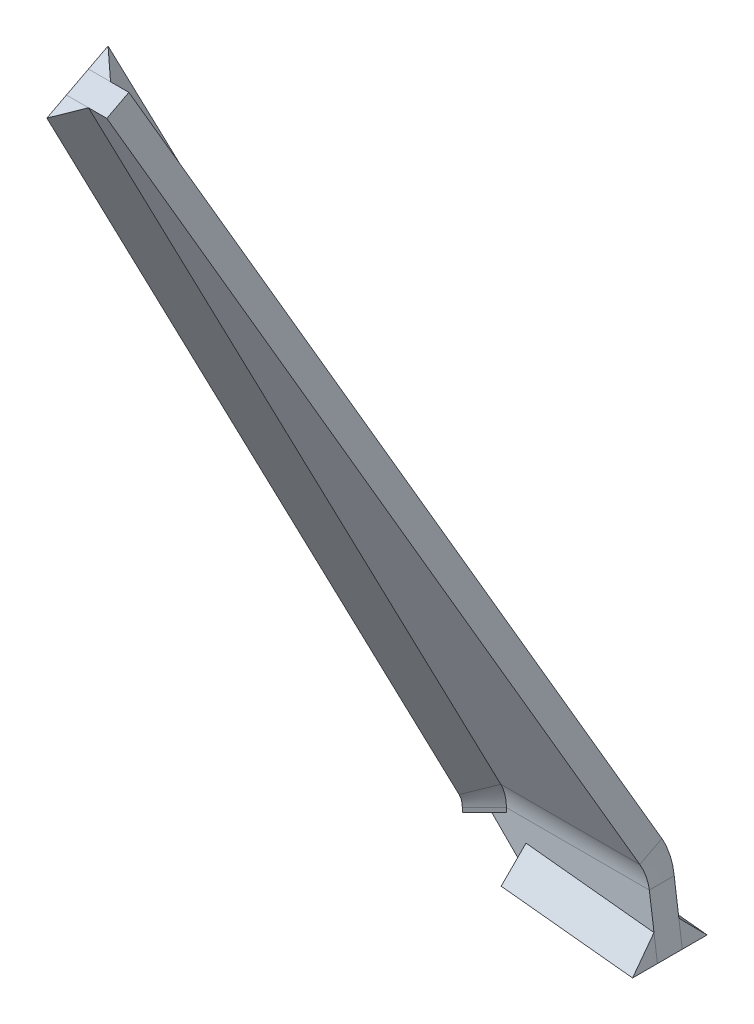
ISO-10303-21;
HEADER;
FILE_DESCRIPTION(('STEP AP214'),'2;1');
FILE_NAME('part.step','',(''),(''),'','','');
FILE_SCHEMA(('AUTOMOTIVE_DESIGN { 1 0 10303 214 1 1 1 1 }'));
ENDSEC;
DATA;
#1=APPLICATION_CONTEXT('core data for automotive mechanical design processes');
#2=APPLICATION_PROTOCOL_DEFINITION('international standard','automotive_design',2000,#1);
#3=PRODUCT_CONTEXT('',#1,'mechanical');
#4=PRODUCT('Part','Part','',(#3));
#5=PRODUCT_RELATED_PRODUCT_CATEGORY('part','',(#4));
#6=PRODUCT_DEFINITION_FORMATION('','',#4);
#7=PRODUCT_DEFINITION_CONTEXT('part definition',#1,'design');
#8=PRODUCT_DEFINITION('design','',#6,#7);
#9=PRODUCT_DEFINITION_SHAPE('','',#8);
#10=(LENGTH_UNIT() NAMED_UNIT(*) SI_UNIT(.MILLI.,.METRE.));
#11=(NAMED_UNIT(*) PLANE_ANGLE_UNIT() SI_UNIT($,.RADIAN.));
#12=(NAMED_UNIT(*) SI_UNIT($,.STERADIAN.) SOLID_ANGLE_UNIT());
#13=UNCERTAINTY_MEASURE_WITH_UNIT(LENGTH_MEASURE(1.E-05),#10,'distance_accuracy_value','');
#14=(GEOMETRIC_REPRESENTATION_CONTEXT(3) GLOBAL_UNCERTAINTY_ASSIGNED_CONTEXT((#13)) GLOBAL_UNIT_ASSIGNED_CONTEXT((#10,
#11,#12)) REPRESENTATION_CONTEXT('',''));
#15=CARTESIAN_POINT('',(0.,0.,0.));
#16=DIRECTION('',(0.,0.,1.));
#17=DIRECTION('',(1.,0.,0.));
#18=AXIS2_PLACEMENT_3D('',#15,#16,#17);
#19=CARTESIAN_POINT('',(3.54804333271289,6.67696676559559,3.99999999585428));
#20=DIRECTION('',(0.,6.51403475213452E-09,1.));
#21=DIRECTION('',(0.,-1.,6.51403475213452E-09));
#22=AXIS2_PLACEMENT_3D('',#19,#20,#21);
#23=PLANE('',#22);
#24=DIRECTION('',(-1.,0.,0.));
#25=VECTOR('',#24,1.);
#26=CARTESIAN_POINT('',(3.54804333271289,6.67696676559559,3.99999999585428));
#27=LINE('',#26,#25);
#28=CARTESIAN_POINT('',(3.54804333271289,6.67696676559559,3.99999999585428));
#29=VERTEX_POINT('',#28);
#30=CARTESIAN_POINT('',(0.,6.67696676559559,3.99999999585428));
#31=VERTEX_POINT('',#30);
#32=EDGE_CURVE('E121',#29,#31,#27,.T.);
#33=ORIENTED_EDGE('',*,*,#32,.F.);
#34=DIRECTION('',(0.,-1.,6.51403475213452E-09));
#35=VECTOR('',#34,1.);
#36=CARTESIAN_POINT('',(3.54804333271289,6.67696676559559,3.99999999585428));
#37=LINE('',#36,#35);
#38=CARTESIAN_POINT('',(3.54804333271289,6.00000000000006,4.00000000026407));
#39=VERTEX_POINT('',#38);
#40=EDGE_CURVE('E64',#29,#39,#37,.T.);
#41=ORIENTED_EDGE('',*,*,#40,.T.);
#42=DIRECTION('',(-1.,0.,0.));
#43=VECTOR('',#42,1.);
#44=CARTESIAN_POINT('',(3.54804333271289,6.00000000000006,4.00000000026407));
#45=LINE('',#44,#43);
#46=CARTESIAN_POINT('',(0.,6.00000000000006,4.00000000026407));
#47=VERTEX_POINT('',#46);
#48=EDGE_CURVE('E71',#39,#47,#45,.T.);
#49=ORIENTED_EDGE('',*,*,#48,.T.);
#50=DIRECTION('',(0.,-1.,6.51403475213452E-09));
#51=VECTOR('',#50,1.);
#52=CARTESIAN_POINT('',(0.,6.67696676559559,3.99999999585428));
#53=LINE('',#52,#51);
#54=EDGE_CURVE('E13',#31,#47,#53,.T.);
#55=ORIENTED_EDGE('',*,*,#54,.F.);
#56=EDGE_LOOP('',(#33,#41,#49,#55));
#57=FACE_BOUND('',#56,.T.);
#58=ADVANCED_FACE('F57',(#57),#23,.F.);
#59=CARTESIAN_POINT('',(0.,6.67696676463847,7.54804332856717));
#60=DIRECTION('',(-0.707106781186548,-4.60611813374007E-09,-0.707106781186547));
#61=DIRECTION('',(-0.707106781186547,0.,0.707106781186548));
#62=AXIS2_PLACEMENT_3D('',#59,#60,#61);
#63=PLANE('',#62);
#64=DIRECTION('',(0.707106781186547,1.90749860351502E-10,-0.707106781186548));
#65=VECTOR('',#64,1.);
#66=CARTESIAN_POINT('',(0.,6.67696676463847,7.54804332856717));
#67=LINE('',#66,#65);
#68=CARTESIAN_POINT('',(0.,6.67696676463847,7.54804332856717));
#69=VERTEX_POINT('',#68);
#70=EDGE_CURVE('E144',#69,#29,#67,.T.);
#71=ORIENTED_EDGE('',*,*,#70,.F.);
#72=DIRECTION('',(0.,-1.,6.51403475213452E-09));
#73=VECTOR('',#72,1.);
#74=CARTESIAN_POINT('',(0.,6.67696676463847,7.54804332856717));
#75=LINE('',#74,#73);
#76=CARTESIAN_POINT('',(0.,5.99999999904293,7.54804333297696));
#77=VERTEX_POINT('',#76);
#78=EDGE_CURVE('E116',#69,#77,#75,.T.);
#79=ORIENTED_EDGE('',*,*,#78,.T.);
#80=DIRECTION('',(0.707106781186547,1.90749860351502E-10,-0.707106781186548));
#81=VECTOR('',#80,1.);
#82=CARTESIAN_POINT('',(0.,5.99999999904293,7.54804333297696));
#83=LINE('',#82,#81);
#84=EDGE_CURVE('E79',#77,#39,#83,.T.);
#85=ORIENTED_EDGE('',*,*,#84,.T.);
#86=ORIENTED_EDGE('',*,*,#40,.F.);
#87=EDGE_LOOP('',(#71,#79,#85,#86));
#88=FACE_BOUND('',#87,.T.);
#89=ADVANCED_FACE('F157',(#88),#63,.F.);
#90=CARTESIAN_POINT('',(0.,6.67696676559554,12.0000000046738));
#91=DIRECTION('',(-1.,0.,0.));
#92=DIRECTION('',(0.,-1.,0.));
#93=AXIS2_PLACEMENT_3D('',#90,#91,#92);
#94=CYLINDRICAL_SURFACE('',#93,8.00000000881955);
#95=DIRECTION('',(-1.,0.,0.));
#96=VECTOR('',#95,1.);
#97=CARTESIAN_POINT('',(3.54804333271289,10.370955673634,4.90391333042855));
#98=LINE('',#97,#96);
#99=CARTESIAN_POINT('',(3.54804333271289,10.370955673634,4.90391333042855));
#100=VERTEX_POINT('',#99);
#101=CARTESIAN_POINT('',(0.,10.370955673634,4.90391333042855));
#102=VERTEX_POINT('',#101);
#103=EDGE_CURVE('E129',#100,#102,#98,.T.);
#104=ORIENTED_EDGE('',*,*,#103,.F.);
#105=CARTESIAN_POINT('',(3.54804333271289,6.67696676559554,12.0000000046738));
#106=DIRECTION('',(-1.,0.,0.));
#107=DIRECTION('',(0.,-1.,0.));
#108=AXIS2_PLACEMENT_3D('',#105,#106,#107);
#109=CIRCLE('',#108,8.00000000881955);
#110=EDGE_CURVE('E120',#100,#29,#109,.T.);
#111=ORIENTED_EDGE('',*,*,#110,.T.);
#112=ORIENTED_EDGE('',*,*,#32,.T.);
#113=CARTESIAN_POINT('',(0.,6.67696676559554,12.0000000046738));
#114=DIRECTION('',(-1.,0.,0.));
#115=DIRECTION('',(0.,-1.,0.));
#116=AXIS2_PLACEMENT_3D('',#113,#114,#115);
#117=CIRCLE('',#116,8.00000000881955);
#118=EDGE_CURVE('E149',#102,#31,#117,.T.);
#119=ORIENTED_EDGE('',*,*,#118,.F.);
#120=EDGE_LOOP('',(#104,#111,#112,#119));
#121=FACE_BOUND('',#120,.T.);
#122=ADVANCED_FACE('F159',(#121),#94,.T.);
#123=CARTESIAN_POINT('',(0.,6.67696676559554,12.0000000046738));
#124=DIRECTION('',(1.,0.,0.));
#125=DIRECTION('',(0.,1.,0.));
#126=AXIS2_PLACEMENT_3D('',#123,#124,#125);
#127=CONICAL_SURFACE('',#126,4.45195667610666,0.785398163397449);
#128=DIRECTION('',(0.707106781186547,0.326505575621977,-0.62721137512625));
#129=VECTOR('',#128,1.);
#130=CARTESIAN_POINT('',(0.,8.73265158505604,8.05106620313065));
#131=LINE('',#130,#129);
#132=CARTESIAN_POINT('',(0.,8.73265158505604,8.05106620313065));
#133=VERTEX_POINT('',#132);
#134=EDGE_CURVE('E124',#133,#100,#131,.T.);
#135=ORIENTED_EDGE('',*,*,#134,.F.);
#136=CARTESIAN_POINT('',(0.,6.67696676559554,12.0000000046738));
#137=DIRECTION('',(-1.,0.,0.));
#138=DIRECTION('',(0.,-1.,0.));
#139=AXIS2_PLACEMENT_3D('',#136,#137,#138);
#140=CIRCLE('',#139,4.45195667610666);
#141=EDGE_CURVE('E109',#133,#69,#140,.T.);
#142=ORIENTED_EDGE('',*,*,#141,.T.);
#143=ORIENTED_EDGE('',*,*,#70,.T.);
#144=ORIENTED_EDGE('',*,*,#110,.F.);
#145=EDGE_LOOP('',(#135,#142,#143,#144));
#146=FACE_BOUND('',#145,.T.);
#147=ADVANCED_FACE('F125',(#146),#127,.F.);
#148=CARTESIAN_POINT('',(0.,10.370955673634,4.90391333042855));
#149=DIRECTION('',(-1.,0.,0.));
#150=DIRECTION('',(0.,-1.,0.));
#151=AXIS2_PLACEMENT_3D('',#148,#149,#150);
#152=PLANE('',#151);
#153=DIRECTION('',(0.,-0.461748613235034,0.887010833178221));
#154=VECTOR('',#153,1.);
#155=CARTESIAN_POINT('',(0.,137.813981670746,71.2465534924042));
#156=LINE('',#155,#154);
#157=CARTESIAN_POINT('',(0.,137.813981670746,71.2465534924042));
#158=VERTEX_POINT('',#157);
#159=CARTESIAN_POINT('',(0.,136.175677582168,74.3937063651063));
#160=VERTEX_POINT('',#159);
#161=EDGE_CURVE('E168',#158,#160,#156,.T.);
#162=ORIENTED_EDGE('',*,*,#161,.F.);
#163=DIRECTION('',(0.,0.887010833163201,0.461748613263889));
#164=VECTOR('',#163,1.);
#165=CARTESIAN_POINT('',(0.,10.370955673634,4.90391333042855));
#166=LINE('',#165,#164);
#167=EDGE_CURVE('E138',#102,#158,#166,.T.);
#168=ORIENTED_EDGE('',*,*,#167,.F.);
#169=ORIENTED_EDGE('',*,*,#118,.T.);
#170=ORIENTED_EDGE('',*,*,#54,.T.);
#171=DIRECTION('',(0.,-2.69761157856152E-10,1.));
#172=VECTOR('',#171,1.);
#173=CARTESIAN_POINT('',(0.,6.00000000000006,4.00000000026407));
#174=LINE('',#173,#172);
#175=EDGE_CURVE('E152',#47,#77,#174,.T.);
#176=ORIENTED_EDGE('',*,*,#175,.T.);
#177=ORIENTED_EDGE('',*,*,#78,.F.);
#178=ORIENTED_EDGE('',*,*,#141,.F.);
#179=DIRECTION('',(0.,0.887010833163201,0.461748613263889));
#180=VECTOR('',#179,1.);
#181=CARTESIAN_POINT('',(0.,8.73265158505604,8.05106620313065));
#182=LINE('',#181,#180);
#183=EDGE_CURVE('E114',#133,#160,#182,.T.);
#184=ORIENTED_EDGE('',*,*,#183,.T.);
#185=EDGE_LOOP('',(#162,#168,#169,#170,#176,#177,#178,#184));
#186=FACE_BOUND('',#185,.T.);
#187=ADVANCED_FACE('F112',(#186),#152,.T.);
#188=CARTESIAN_POINT('',(3.54804333271289,10.370955673634,4.90391333042855));
#189=DIRECTION('',(0.,0.461748613263889,-0.887010833163201));
#190=DIRECTION('',(0.,0.887010833163201,0.461748613263889));
#191=AXIS2_PLACEMENT_3D('',#188,#189,#190);
#192=PLANE('',#191);
#193=DIRECTION('',(-1.,0.,0.));
#194=VECTOR('',#193,1.);
#195=CARTESIAN_POINT('',(3.54804333271288,137.813981670746,71.2465534924042));
#196=LINE('',#195,#194);
#197=CARTESIAN_POINT('',(3.54804333271288,137.813981670746,71.2465534924042));
#198=VERTEX_POINT('',#197);
#199=EDGE_CURVE('E130',#198,#158,#196,.T.);
#200=ORIENTED_EDGE('',*,*,#199,.F.);
#201=DIRECTION('',(0.,0.887010833163201,0.461748613263889));
#202=VECTOR('',#201,1.);
#203=CARTESIAN_POINT('',(3.54804333271289,10.370955673634,4.90391333042855));
#204=LINE('',#203,#202);
#205=EDGE_CURVE('E136',#100,#198,#204,.T.);
#206=ORIENTED_EDGE('',*,*,#205,.F.);
#207=ORIENTED_EDGE('',*,*,#103,.T.);
#208=ORIENTED_EDGE('',*,*,#167,.T.);
#209=EDGE_LOOP('',(#200,#206,#207,#208));
#210=FACE_BOUND('',#209,.T.);
#211=ADVANCED_FACE('F164',(#210),#192,.T.);
#212=CARTESIAN_POINT('',(0.,8.73265158505604,8.05106620313065));
#213=DIRECTION('',(0.707106781186548,-0.326505575642381,0.627211375115628));
#214=DIRECTION('',(0.663578618394135,0.,-0.748106554716727));
#215=AXIS2_PLACEMENT_3D('',#212,#213,#214);
#216=PLANE('',#215);
#217=DIRECTION('',(0.707106781186547,0.326505575621977,-0.62721137512625));
#218=VECTOR('',#217,1.);
#219=CARTESIAN_POINT('',(0.,136.175677582168,74.3937063651063));
#220=LINE('',#219,#218);
#221=EDGE_CURVE('E134',#160,#198,#220,.T.);
#222=ORIENTED_EDGE('',*,*,#221,.F.);
#223=ORIENTED_EDGE('',*,*,#183,.F.);
#224=ORIENTED_EDGE('',*,*,#134,.T.);
#225=ORIENTED_EDGE('',*,*,#205,.T.);
#226=EDGE_LOOP('',(#222,#223,#224,#225));
#227=FACE_BOUND('',#226,.T.);
#228=ADVANCED_FACE('F132',(#227),#216,.T.);
#229=CARTESIAN_POINT('',(0.,6.00000000000006,4.00000000026407));
#230=DIRECTION('',(0.,-1.,-2.69761157856152E-10));
#231=DIRECTION('',(0.,2.69761157856152E-10,-1.));
#232=AXIS2_PLACEMENT_3D('',#229,#230,#231);
#233=PLANE('',#232);
#234=ORIENTED_EDGE('',*,*,#175,.F.);
#235=ORIENTED_EDGE('',*,*,#48,.F.);
#236=ORIENTED_EDGE('',*,*,#84,.F.);
#237=EDGE_LOOP('',(#234,#235,#236));
#238=FACE_BOUND('',#237,.T.);
#239=ADVANCED_FACE('F173',(#238),#233,.T.);
#240=CARTESIAN_POINT('',(0.,137.813981670746,71.2465534924042));
#241=DIRECTION('',(0.,-0.887010833178221,-0.461748613235034));
#242=DIRECTION('',(0.,0.461748613235034,-0.887010833178221));
#243=AXIS2_PLACEMENT_3D('',#240,#241,#242);
#244=PLANE('',#243);
#245=ORIENTED_EDGE('',*,*,#161,.T.);
#246=ORIENTED_EDGE('',*,*,#221,.T.);
#247=ORIENTED_EDGE('',*,*,#199,.T.);
#248=EDGE_LOOP('',(#245,#246,#247));
#249=FACE_BOUND('',#248,.T.);
#250=ADVANCED_FACE('F167',(#249),#244,.F.);
#251=CLOSED_SHELL('',(#58,#89,#122,#147,#187,#211,#228,#239,#250));
#252=MANIFOLD_SOLID_BREP('B2',#251);
#253=CARTESIAN_POINT('',(3.54804333271289,6.67696676667466,-4.14576012408574E-09));
#254=DIRECTION('',(0.,-6.51403475213451E-09,-1.));
#255=DIRECTION('',(0.,1.,-6.51403475213451E-09));
#256=AXIS2_PLACEMENT_3D('',#253,#254,#255);
#257=PLANE('',#256);
#258=DIRECTION('',(1.,0.,0.));
#259=VECTOR('',#258,1.);
#260=CARTESIAN_POINT('',(3.54804333271289,6.67696676667466,-4.14576012408574E-09));
#261=LINE('',#260,#259);
#262=CARTESIAN_POINT('',(0.,6.67696676667466,-4.14575838936226E-09));
#263=VERTEX_POINT('',#262);
#264=CARTESIAN_POINT('',(3.54804333271289,6.67696676667466,-4.14576012408574E-09));
#265=VERTEX_POINT('',#264);
#266=EDGE_CURVE('E326',#263,#265,#261,.T.);
#267=ORIENTED_EDGE('',*,*,#266,.F.);
#268=DIRECTION('',(0.,-1.,6.51403475213452E-09));
#269=VECTOR('',#268,1.);
#270=CARTESIAN_POINT('',(0.,6.67696676667466,-4.14575838936226E-09));
#271=LINE('',#270,#269);
#272=CARTESIAN_POINT('',(0.,6.00000000107912,2.64026647767146E-10));
#273=VERTEX_POINT('',#272);
#274=EDGE_CURVE('E269',#263,#273,#271,.T.);
#275=ORIENTED_EDGE('',*,*,#274,.T.);
#276=DIRECTION('',(1.,0.,0.));
#277=VECTOR('',#276,1.);
#278=CARTESIAN_POINT('',(3.54804333271289,6.00000000107912,2.6402491304367E-10));
#279=LINE('',#278,#277);
#280=CARTESIAN_POINT('',(3.54804333271289,6.00000000107912,2.6402491304367E-10));
#281=VERTEX_POINT('',#280);
#282=EDGE_CURVE('E276',#273,#281,#279,.T.);
#283=ORIENTED_EDGE('',*,*,#282,.T.);
#284=DIRECTION('',(0.,-1.,6.51403475213452E-09));
#285=VECTOR('',#284,1.);
#286=CARTESIAN_POINT('',(3.54804333271289,6.67696676667466,-4.14576012408574E-09));
#287=LINE('',#286,#285);
#288=EDGE_CURVE('E55',#265,#281,#287,.T.);
#289=ORIENTED_EDGE('',*,*,#288,.F.);
#290=EDGE_LOOP('',(#267,#275,#283,#289));
#291=FACE_BOUND('',#290,.T.);
#292=ADVANCED_FACE('F262',(#291),#257,.F.);
#293=CARTESIAN_POINT('',(0.,6.67696676763178,-3.54804333685865));
#294=DIRECTION('',(-0.707106781186548,4.60611815849822E-09,0.707106781186547));
#295=DIRECTION('',(0.707106781186547,0.,0.707106781186548));
#296=AXIS2_PLACEMENT_3D('',#293,#294,#295);
#297=PLANE('',#296);
#298=DIRECTION('',(-0.707106781186547,1.90749971373805E-10,-0.707106781186548));
#299=VECTOR('',#298,1.);
#300=CARTESIAN_POINT('',(0.,6.67696676763178,-3.54804333685865));
#301=LINE('',#300,#299);
#302=CARTESIAN_POINT('',(0.,6.67696676763178,-3.54804333685865));
#303=VERTEX_POINT('',#302);
#304=EDGE_CURVE('E324',#265,#303,#301,.T.);
#305=ORIENTED_EDGE('',*,*,#304,.F.);
#306=ORIENTED_EDGE('',*,*,#288,.T.);
#307=DIRECTION('',(-0.707106781186547,1.90749971373805E-10,-0.707106781186548));
#308=VECTOR('',#307,1.);
#309=CARTESIAN_POINT('',(0.,6.00000000203625,-3.54804333244886));
#310=LINE('',#309,#308);
#311=CARTESIAN_POINT('',(0.,6.00000000203625,-3.54804333244886));
#312=VERTEX_POINT('',#311);
#313=EDGE_CURVE('E360',#281,#312,#310,.T.);
#314=ORIENTED_EDGE('',*,*,#313,.T.);
#315=DIRECTION('',(0.,-1.,6.51403475213452E-09));
#316=VECTOR('',#315,1.);
#317=CARTESIAN_POINT('',(0.,6.67696676763178,-3.54804333685865));
#318=LINE('',#317,#316);
#319=EDGE_CURVE('E364',#303,#312,#318,.T.);
#320=ORIENTED_EDGE('',*,*,#319,.F.);
#321=EDGE_LOOP('',(#305,#306,#314,#320));
#322=FACE_BOUND('',#321,.T.);
#323=ADVANCED_FACE('F385',(#322),#297,.F.);
#324=CARTESIAN_POINT('',(0.,6.67696676559554,12.0000000046738));
#325=DIRECTION('',(-1.,0.,0.));
#326=DIRECTION('',(0.,-1.,0.));
#327=AXIS2_PLACEMENT_3D('',#324,#325,#326);
#328=CYLINDRICAL_SURFACE('',#327,12.0000000088196);
#329=DIRECTION('',(1.,0.,0.));
#330=VECTOR('',#329,1.);
#331=CARTESIAN_POINT('',(3.54804333271289,12.2179501265742,1.35586999771564));
#332=LINE('',#331,#330);
#333=CARTESIAN_POINT('',(0.,12.2179501265742,1.35586999771564));
#334=VERTEX_POINT('',#333);
#335=CARTESIAN_POINT('',(3.54804333271289,12.2179501265742,1.35586999771564));
#336=VERTEX_POINT('',#335);
#337=EDGE_CURVE('E337',#334,#336,#332,.T.);
#338=ORIENTED_EDGE('',*,*,#337,.F.);
#339=CARTESIAN_POINT('',(0.,6.67696676559554,12.0000000046738));
#340=DIRECTION('',(-1.,0.,0.));
#341=DIRECTION('',(0.,-1.,0.));
#342=AXIS2_PLACEMENT_3D('',#339,#340,#341);
#343=CIRCLE('',#342,12.0000000088196);
#344=EDGE_CURVE('E325',#334,#263,#343,.T.);
#345=ORIENTED_EDGE('',*,*,#344,.T.);
#346=ORIENTED_EDGE('',*,*,#266,.T.);
#347=CARTESIAN_POINT('',(3.54804333271289,6.67696676559554,12.0000000046738));
#348=DIRECTION('',(-1.,0.,0.));
#349=DIRECTION('',(0.,-1.,0.));
#350=AXIS2_PLACEMENT_3D('',#347,#348,#349);
#351=CIRCLE('',#350,12.0000000088196);
#352=EDGE_CURVE('E358',#336,#265,#351,.T.);
#353=ORIENTED_EDGE('',*,*,#352,.F.);
#354=EDGE_LOOP('',(#338,#345,#346,#353));
#355=FACE_BOUND('',#354,.T.);
#356=ADVANCED_FACE('F369',(#355),#328,.F.);
#357=CARTESIAN_POINT('',(3.54804333271289,6.67696676559554,12.0000000046738));
#358=DIRECTION('',(-1.,0.,0.));
#359=DIRECTION('',(0.,-1.,0.));
#360=AXIS2_PLACEMENT_3D('',#357,#358,#359);
#361=CONICAL_SURFACE('',#360,12.0000000088196,0.785398163397448);
#362=DIRECTION('',(-0.707106781186547,0.326505575621977,-0.62721137512625));
#363=VECTOR('',#362,1.);
#364=CARTESIAN_POINT('',(0.,13.8562542151522,-1.79128287498645));
#365=LINE('',#364,#363);
#366=CARTESIAN_POINT('',(0.,13.8562542151522,-1.79128287498645));
#367=VERTEX_POINT('',#366);
#368=EDGE_CURVE('E321',#336,#367,#365,.T.);
#369=ORIENTED_EDGE('',*,*,#368,.F.);
#370=ORIENTED_EDGE('',*,*,#352,.T.);
#371=ORIENTED_EDGE('',*,*,#304,.T.);
#372=CARTESIAN_POINT('',(0.,6.67696676559554,12.0000000046738));
#373=DIRECTION('',(-1.,0.,0.));
#374=DIRECTION('',(0.,-1.,0.));
#375=AXIS2_PLACEMENT_3D('',#372,#373,#374);
#376=CIRCLE('',#375,15.5480433415325);
#377=EDGE_CURVE('E316',#367,#303,#376,.T.);
#378=ORIENTED_EDGE('',*,*,#377,.F.);
#379=EDGE_LOOP('',(#369,#370,#371,#378));
#380=FACE_BOUND('',#379,.T.);
#381=ADVANCED_FACE('F318',(#380),#361,.T.);
#382=CARTESIAN_POINT('',(0.,13.8562542151522,-1.79128287498645));
#383=DIRECTION('',(0.707106781186548,0.326505575642381,-0.627211375115628));
#384=DIRECTION('',(-0.663578618394135,0.,-0.748106554716727));
#385=AXIS2_PLACEMENT_3D('',#382,#383,#384);
#386=PLANE('',#385);
#387=DIRECTION('',(-0.707106781186547,0.326505575621977,-0.62721137512625));
#388=VECTOR('',#387,1.);
#389=CARTESIAN_POINT('',(0.,141.299280212265,64.5513572869892));
#390=LINE('',#389,#388);
#391=CARTESIAN_POINT('',(3.54804333271288,139.660976123687,67.6985101596913));
#392=VERTEX_POINT('',#391);
#393=CARTESIAN_POINT('',(0.,141.299280212265,64.5513572869892));
#394=VERTEX_POINT('',#393);
#395=EDGE_CURVE('E348',#392,#394,#390,.T.);
#396=ORIENTED_EDGE('',*,*,#395,.F.);
#397=DIRECTION('',(0.,0.887010833163201,0.461748613263889));
#398=VECTOR('',#397,1.);
#399=CARTESIAN_POINT('',(3.54804333271289,12.2179501265742,1.35586999771564));
#400=LINE('',#399,#398);
#401=EDGE_CURVE('E340',#336,#392,#400,.T.);
#402=ORIENTED_EDGE('',*,*,#401,.F.);
#403=ORIENTED_EDGE('',*,*,#368,.T.);
#404=DIRECTION('',(0.,0.887010833163201,0.461748613263889));
#405=VECTOR('',#404,1.);
#406=CARTESIAN_POINT('',(0.,13.8562542151522,-1.79128287498645));
#407=LINE('',#406,#405);
#408=EDGE_CURVE('E329',#367,#394,#407,.T.);
#409=ORIENTED_EDGE('',*,*,#408,.T.);
#410=EDGE_LOOP('',(#396,#402,#403,#409));
#411=FACE_BOUND('',#410,.T.);
#412=ADVANCED_FACE('F339',(#411),#386,.T.);
#413=CARTESIAN_POINT('',(3.54804333271289,12.2179501265742,1.35586999771564));
#414=DIRECTION('',(0.,-0.461748613263889,0.887010833163201));
#415=DIRECTION('',(0.,-0.887010833163201,-0.461748613263889));
#416=AXIS2_PLACEMENT_3D('',#413,#414,#415);
#417=PLANE('',#416);
#418=DIRECTION('',(1.,0.,0.));
#419=VECTOR('',#418,1.);
#420=CARTESIAN_POINT('',(3.54804333271288,139.660976123687,67.6985101596913));
#421=LINE('',#420,#419);
#422=CARTESIAN_POINT('',(0.,139.660976123687,67.6985101596913));
#423=VERTEX_POINT('',#422);
#424=EDGE_CURVE('E342',#423,#392,#421,.T.);
#425=ORIENTED_EDGE('',*,*,#424,.F.);
#426=DIRECTION('',(0.,0.887010833163201,0.461748613263889));
#427=VECTOR('',#426,1.);
#428=CARTESIAN_POINT('',(0.,12.2179501265742,1.35586999771564));
#429=LINE('',#428,#427);
#430=EDGE_CURVE('E336',#334,#423,#429,.T.);
#431=ORIENTED_EDGE('',*,*,#430,.F.);
#432=ORIENTED_EDGE('',*,*,#337,.T.);
#433=ORIENTED_EDGE('',*,*,#401,.T.);
#434=EDGE_LOOP('',(#425,#431,#432,#433));
#435=FACE_BOUND('',#434,.T.);
#436=ADVANCED_FACE('F372',(#435),#417,.T.);
#437=CARTESIAN_POINT('',(0.,12.2179501265742,1.35586999771564));
#438=DIRECTION('',(-1.,0.,0.));
#439=DIRECTION('',(0.,-1.,0.));
#440=AXIS2_PLACEMENT_3D('',#437,#438,#439);
#441=PLANE('',#440);
#442=DIRECTION('',(0.,-0.461748613235034,0.887010833178221));
#443=VECTOR('',#442,1.);
#444=CARTESIAN_POINT('',(0.,139.660976123687,67.6985101596913));
#445=LINE('',#444,#443);
#446=EDGE_CURVE('E332',#394,#423,#445,.T.);
#447=ORIENTED_EDGE('',*,*,#446,.F.);
#448=ORIENTED_EDGE('',*,*,#408,.F.);
#449=ORIENTED_EDGE('',*,*,#377,.T.);
#450=ORIENTED_EDGE('',*,*,#319,.T.);
#451=DIRECTION('',(0.,-2.69761157856152E-10,1.));
#452=VECTOR('',#451,1.);
#453=CARTESIAN_POINT('',(0.,6.00000000107912,2.64026647767146E-10));
#454=LINE('',#453,#452);
#455=EDGE_CURVE('E284',#312,#273,#454,.T.);
#456=ORIENTED_EDGE('',*,*,#455,.T.);
#457=ORIENTED_EDGE('',*,*,#274,.F.);
#458=ORIENTED_EDGE('',*,*,#344,.F.);
#459=ORIENTED_EDGE('',*,*,#430,.T.);
#460=EDGE_LOOP('',(#447,#448,#449,#450,#456,#457,#458,#459));
#461=FACE_BOUND('',#460,.T.);
#462=ADVANCED_FACE('F330',(#461),#441,.T.);
#463=CARTESIAN_POINT('',(3.54804333271289,6.00000000107912,2.6402491304367E-10));
#464=DIRECTION('',(0.,-1.,-2.69761102345001E-10));
#465=DIRECTION('',(0.,2.69761102345001E-10,-1.));
#466=AXIS2_PLACEMENT_3D('',#463,#464,#465);
#467=PLANE('',#466);
#468=ORIENTED_EDGE('',*,*,#313,.F.);
#469=ORIENTED_EDGE('',*,*,#282,.F.);
#470=ORIENTED_EDGE('',*,*,#455,.F.);
#471=EDGE_LOOP('',(#468,#469,#470));
#472=FACE_BOUND('',#471,.T.);
#473=ADVANCED_FACE('F376',(#472),#467,.T.);
#474=CARTESIAN_POINT('',(3.54804333271288,139.660976123687,67.6985101596913));
#475=DIRECTION('',(0.,-0.887010833178221,-0.461748613235034));
#476=DIRECTION('',(0.,0.461748613235034,-0.887010833178221));
#477=AXIS2_PLACEMENT_3D('',#474,#475,#476);
#478=PLANE('',#477);
#479=ORIENTED_EDGE('',*,*,#395,.T.);
#480=ORIENTED_EDGE('',*,*,#446,.T.);
#481=ORIENTED_EDGE('',*,*,#424,.T.);
#482=EDGE_LOOP('',(#479,#480,#481));
#483=FACE_BOUND('',#482,.T.);
#484=ADVANCED_FACE('F374',(#483),#478,.F.);
#485=CLOSED_SHELL('',(#292,#323,#356,#381,#412,#436,#462,#473,#484));
#486=MANIFOLD_SOLID_BREP('B7',#485);
#487=CARTESIAN_POINT('',(6.70469146960511,-0.704691469605121,4.));
#488=DIRECTION('',(-1.,0.,0.));
#489=DIRECTION('',(0.,0.,1.));
#490=AXIS2_PLACEMENT_3D('',#487,#488,#489);
#491=PLANE('',#490);
#492=DIRECTION('',(0.,1.,0.));
#493=VECTOR('',#492,1.);
#494=CARTESIAN_POINT('',(6.70469146960511,3.29530853039488,4.));
#495=LINE('',#494,#493);
#496=CARTESIAN_POINT('',(6.70469146960511,-0.704691469605121,4.));
#497=VERTEX_POINT('',#496);
#498=CARTESIAN_POINT('',(6.70469146960511,3.29530853039488,4.));
#499=VERTEX_POINT('',#498);
#500=EDGE_CURVE('E509',#497,#499,#495,.T.);
#501=ORIENTED_EDGE('',*,*,#500,.F.);
#502=DIRECTION('',(0.,0.,-1.));
#503=VECTOR('',#502,1.);
#504=CARTESIAN_POINT('',(6.70469146960511,-0.704691469605121,4.));
#505=LINE('',#504,#503);
#506=CARTESIAN_POINT('',(6.70469146960511,-0.704691469605122,8.));
#507=VERTEX_POINT('',#506);
#508=EDGE_CURVE('E511',#507,#497,#505,.T.);
#509=ORIENTED_EDGE('',*,*,#508,.F.);
#510=DIRECTION('',(0.,-0.707106781186548,0.707106781186547));
#511=VECTOR('',#510,1.);
#512=CARTESIAN_POINT('',(6.70469146960511,3.29530853039488,4.));
#513=LINE('',#512,#511);
#514=EDGE_CURVE('E502',#499,#507,#513,.T.);
#515=ORIENTED_EDGE('',*,*,#514,.F.);
#516=EDGE_LOOP('',(#501,#509,#515));
#517=FACE_BOUND('',#516,.T.);
#518=ADVANCED_FACE('F467',(#517),#491,.T.);
#519=CARTESIAN_POINT('',(33.2805950239565,-3.49793148917952,4.));
#520=DIRECTION('',(0.104528463267651,0.994521895368274,0.));
#521=DIRECTION('',(-0.994521895368274,0.104528463267651,0.));
#522=AXIS2_PLACEMENT_3D('',#519,#520,#521);
#523=PLANE('',#522);
#524=DIRECTION('',(-0.994521895368274,0.104528463267651,0.));
#525=VECTOR('',#524,1.);
#526=CARTESIAN_POINT('',(33.2805950239565,-3.49793148917952,4.));
#527=LINE('',#526,#525);
#528=CARTESIAN_POINT('',(27.8466130703117,-2.92679697149421,4.));
#529=VERTEX_POINT('',#528);
#530=EDGE_CURVE('E514',#529,#497,#527,.T.);
#531=ORIENTED_EDGE('',*,*,#530,.F.);
#532=DIRECTION('',(0.,0.,1.));
#533=VECTOR('',#532,1.);
#534=CARTESIAN_POINT('',(27.8466130703117,-2.92679697149421,4.));
#535=LINE('',#534,#533);
#536=CARTESIAN_POINT('',(27.8466130703117,-2.92679697149421,8.));
#537=VERTEX_POINT('',#536);
#538=EDGE_CURVE('E471',#529,#537,#535,.T.);
#539=ORIENTED_EDGE('',*,*,#538,.T.);
#540=DIRECTION('',(-0.994521895368274,0.104528463267651,0.));
#541=VECTOR('',#540,1.);
#542=CARTESIAN_POINT('',(33.2805950239565,-3.49793148917952,8.));
#543=LINE('',#542,#541);
#544=EDGE_CURVE('E506',#537,#507,#543,.T.);
#545=ORIENTED_EDGE('',*,*,#544,.T.);
#546=ORIENTED_EDGE('',*,*,#508,.T.);
#547=EDGE_LOOP('',(#531,#539,#545,#546));
#548=FACE_BOUND('',#547,.T.);
#549=ADVANCED_FACE('F522',(#548),#523,.F.);
#550=CARTESIAN_POINT('',(33.2805950239565,0.502068510820482,4.));
#551=DIRECTION('',(-0.0741155126847491,-0.70516199939428,-0.70516199939428));
#552=DIRECTION('',(0.,0.707106781186548,-0.707106781186547));
#553=AXIS2_PLACEMENT_3D('',#550,#551,#552);
#554=PLANE('',#553);
#555=ORIENTED_EDGE('',*,*,#544,.F.);
#556=DIRECTION('',(-0.0958164778483682,0.708870741875587,-0.698800024245483));
#557=VECTOR('',#556,1.);
#558=CARTESIAN_POINT('',(27.3957814505822,0.408551518817847,4.71203582231319));
#559=LINE('',#558,#557);
#560=CARTESIAN_POINT('',(27.2981501365742,1.13084880572783,4.));
#561=VERTEX_POINT('',#560);
#562=EDGE_CURVE('E477',#537,#561,#559,.T.);
#563=ORIENTED_EDGE('',*,*,#562,.T.);
#564=DIRECTION('',(-0.994521895368274,0.104528463267651,0.));
#565=VECTOR('',#564,1.);
#566=CARTESIAN_POINT('',(33.2805950239565,0.502068510820482,4.));
#567=LINE('',#566,#565);
#568=EDGE_CURVE('E498',#561,#499,#567,.T.);
#569=ORIENTED_EDGE('',*,*,#568,.T.);
#570=ORIENTED_EDGE('',*,*,#514,.T.);
#571=EDGE_LOOP('',(#555,#563,#569,#570));
#572=FACE_BOUND('',#571,.T.);
#573=ADVANCED_FACE('F501',(#572),#554,.F.);
#574=CARTESIAN_POINT('',(33.2805950239565,0.502068510820482,4.));
#575=DIRECTION('',(0.,0.,1.));
#576=DIRECTION('',(0.,-1.,0.));
#577=AXIS2_PLACEMENT_3D('',#574,#575,#576);
#578=PLANE('',#577);
#579=ORIENTED_EDGE('',*,*,#568,.F.);
#580=DIRECTION('',(0.133949657316128,-0.990988137822493,0.));
#581=VECTOR('',#580,1.);
#582=CARTESIAN_POINT('',(27.4889560997429,-0.280774410893807,4.));
#583=LINE('',#582,#581);
#584=EDGE_CURVE('E260',#561,#529,#583,.T.);
#585=ORIENTED_EDGE('',*,*,#584,.T.);
#586=ORIENTED_EDGE('',*,*,#530,.T.);
#587=ORIENTED_EDGE('',*,*,#500,.T.);
#588=EDGE_LOOP('',(#579,#585,#586,#587));
#589=FACE_BOUND('',#588,.T.);
#590=ADVANCED_FACE('F469',(#589),#578,.F.);
#591=CARTESIAN_POINT('',(27.8466130703117,-2.92679697149421,4.));
#592=DIRECTION('',(-0.990988137822493,-0.133949657316128,0.));
#593=DIRECTION('',(0.133949657316128,-0.990988137822493,0.));
#594=AXIS2_PLACEMENT_3D('',#591,#592,#593);
#595=PLANE('',#594);
#596=ORIENTED_EDGE('',*,*,#562,.F.);
#597=ORIENTED_EDGE('',*,*,#538,.F.);
#598=ORIENTED_EDGE('',*,*,#584,.F.);
#599=EDGE_LOOP('',(#596,#597,#598));
#600=FACE_BOUND('',#599,.T.);
#601=ADVANCED_FACE('F523',(#600),#595,.F.);
#602=CLOSED_SHELL('',(#518,#549,#573,#590,#601));
#603=MANIFOLD_SOLID_BREP('B49',#602);
#604=CARTESIAN_POINT('',(6.70469146960511,-0.70469146960512,-4.));
#605=DIRECTION('',(1.,0.,0.));
#606=DIRECTION('',(0.,0.,-1.));
#607=AXIS2_PLACEMENT_3D('',#604,#605,#606);
#608=PLANE('',#607);
#609=DIRECTION('',(0.,0.707106781186547,0.707106781186548));
#610=VECTOR('',#609,1.);
#611=CARTESIAN_POINT('',(6.70469146960511,3.29530853039488,0.));
#612=LINE('',#611,#610);
#613=CARTESIAN_POINT('',(6.70469146960511,-0.70469146960512,-4.));
#614=VERTEX_POINT('',#613);
#615=CARTESIAN_POINT('',(6.70469146960511,3.29530853039488,0.));
#616=VERTEX_POINT('',#615);
#617=EDGE_CURVE('E615',#614,#616,#612,.T.);
#618=ORIENTED_EDGE('',*,*,#617,.F.);
#619=DIRECTION('',(0.,0.,-1.));
#620=VECTOR('',#619,1.);
#621=CARTESIAN_POINT('',(6.70469146960511,-0.70469146960512,0.));
#622=LINE('',#621,#620);
#623=CARTESIAN_POINT('',(6.70469146960511,-0.70469146960512,0.));
#624=VERTEX_POINT('',#623);
#625=EDGE_CURVE('E617',#624,#614,#622,.T.);
#626=ORIENTED_EDGE('',*,*,#625,.F.);
#627=DIRECTION('',(0.,-1.,0.));
#628=VECTOR('',#627,1.);
#629=CARTESIAN_POINT('',(6.70469146960511,3.29530853039488,0.));
#630=LINE('',#629,#628);
#631=EDGE_CURVE('E608',#616,#624,#630,.T.);
#632=ORIENTED_EDGE('',*,*,#631,.F.);
#633=EDGE_LOOP('',(#618,#626,#632));
#634=FACE_BOUND('',#633,.T.);
#635=ADVANCED_FACE('F573',(#634),#608,.F.);
#636=CARTESIAN_POINT('',(33.2805950239565,-3.49793148917952,0.));
#637=DIRECTION('',(0.104528463267651,0.994521895368274,0.));
#638=DIRECTION('',(-0.994521895368274,0.104528463267651,0.));
#639=AXIS2_PLACEMENT_3D('',#636,#637,#638);
#640=PLANE('',#639);
#641=DIRECTION('',(-0.994521895368274,0.104528463267651,0.));
#642=VECTOR('',#641,1.);
#643=CARTESIAN_POINT('',(33.2805950239565,-3.49793148917952,-4.));
#644=LINE('',#643,#642);
#645=CARTESIAN_POINT('',(27.8466130703117,-2.92679697149421,-4.));
#646=VERTEX_POINT('',#645);
#647=EDGE_CURVE('E620',#646,#614,#644,.T.);
#648=ORIENTED_EDGE('',*,*,#647,.F.);
#649=DIRECTION('',(0.,0.,1.));
#650=VECTOR('',#649,1.);
#651=CARTESIAN_POINT('',(27.8466130703117,-2.92679697149421,0.));
#652=LINE('',#651,#650);
#653=CARTESIAN_POINT('',(27.8466130703117,-2.92679697149421,0.));
#654=VERTEX_POINT('',#653);
#655=EDGE_CURVE('E577',#646,#654,#652,.T.);
#656=ORIENTED_EDGE('',*,*,#655,.T.);
#657=DIRECTION('',(-0.994521895368274,0.104528463267651,0.));
#658=VECTOR('',#657,1.);
#659=CARTESIAN_POINT('',(33.2805950239565,-3.49793148917952,0.));
#660=LINE('',#659,#658);
#661=EDGE_CURVE('E612',#654,#624,#660,.T.);
#662=ORIENTED_EDGE('',*,*,#661,.T.);
#663=ORIENTED_EDGE('',*,*,#625,.T.);
#664=EDGE_LOOP('',(#648,#656,#662,#663));
#665=FACE_BOUND('',#664,.T.);
#666=ADVANCED_FACE('F628',(#665),#640,.F.);
#667=CARTESIAN_POINT('',(33.2805950239565,0.502068510820482,0.));
#668=DIRECTION('',(0.,0.,-1.));
#669=DIRECTION('',(0.,1.,0.));
#670=AXIS2_PLACEMENT_3D('',#667,#668,#669);
#671=PLANE('',#670);
#672=ORIENTED_EDGE('',*,*,#661,.F.);
#673=DIRECTION('',(-0.133949657316128,0.990988137822493,0.));
#674=VECTOR('',#673,1.);
#675=CARTESIAN_POINT('',(27.4889560997429,-0.280774410893806,0.));
#676=LINE('',#675,#674);
#677=CARTESIAN_POINT('',(27.2981501365742,1.13084880572784,0.));
#678=VERTEX_POINT('',#677);
#679=EDGE_CURVE('E583',#654,#678,#676,.T.);
#680=ORIENTED_EDGE('',*,*,#679,.T.);
#681=DIRECTION('',(-0.994521895368274,0.104528463267651,0.));
#682=VECTOR('',#681,1.);
#683=CARTESIAN_POINT('',(33.2805950239565,0.502068510820482,0.));
#684=LINE('',#683,#682);
#685=EDGE_CURVE('E604',#678,#616,#684,.T.);
#686=ORIENTED_EDGE('',*,*,#685,.T.);
#687=ORIENTED_EDGE('',*,*,#631,.T.);
#688=EDGE_LOOP('',(#672,#680,#686,#687));
#689=FACE_BOUND('',#688,.T.);
#690=ADVANCED_FACE('F607',(#689),#671,.F.);
#691=CARTESIAN_POINT('',(33.2805950239565,0.502068510820482,0.));
#692=DIRECTION('',(-0.0741155126847491,-0.70516199939428,0.70516199939428));
#693=DIRECTION('',(0.,-0.707106781186548,-0.707106781186548));
#694=AXIS2_PLACEMENT_3D('',#691,#692,#693);
#695=PLANE('',#694);
#696=ORIENTED_EDGE('',*,*,#685,.F.);
#697=DIRECTION('',(0.0958164778483682,-0.708870741875587,-0.698800024245484));
#698=VECTOR('',#697,1.);
#699=CARTESIAN_POINT('',(27.3957814505822,0.408551518817848,-0.712035822313192));
#700=LINE('',#699,#698);
#701=EDGE_CURVE('E465',#678,#646,#700,.T.);
#702=ORIENTED_EDGE('',*,*,#701,.T.);
#703=ORIENTED_EDGE('',*,*,#647,.T.);
#704=ORIENTED_EDGE('',*,*,#617,.T.);
#705=EDGE_LOOP('',(#696,#702,#703,#704));
#706=FACE_BOUND('',#705,.T.);
#707=ADVANCED_FACE('F575',(#706),#695,.F.);
#708=CARTESIAN_POINT('',(27.8466130703117,-2.92679697149421,4.));
#709=DIRECTION('',(-0.990988137822493,-0.133949657316128,0.));
#710=DIRECTION('',(0.133949657316128,-0.990988137822493,0.));
#711=AXIS2_PLACEMENT_3D('',#708,#709,#710);
#712=PLANE('',#711);
#713=ORIENTED_EDGE('',*,*,#679,.F.);
#714=ORIENTED_EDGE('',*,*,#655,.F.);
#715=ORIENTED_EDGE('',*,*,#701,.F.);
#716=EDGE_LOOP('',(#713,#714,#715));
#717=FACE_BOUND('',#716,.T.);
#718=ADVANCED_FACE('F629',(#717),#712,.F.);
#719=CLOSED_SHELL('',(#635,#666,#690,#707,#718));
#720=MANIFOLD_SOLID_BREP('B254',#719);
#721=CARTESIAN_POINT('',(0.,137.813981670746,71.2465534924041));
#722=DIRECTION('',(1.,0.,0.));
#723=DIRECTION('',(0.,0.887010833178221,0.461748613235035));
#724=AXIS2_PLACEMENT_3D('',#721,#722,#723);
#725=PLANE('',#724);
#726=DIRECTION('',(0.,-0.887010833178221,-0.461748613235035));
#727=VECTOR('',#726,1.);
#728=CARTESIAN_POINT('',(0.,139.660976123686,67.6985101596913));
#729=LINE('',#728,#727);
#730=CARTESIAN_POINT('',(0.,139.660976123686,67.6985101596913));
#731=VERTEX_POINT('',#730);
#732=CARTESIAN_POINT('',(0.,12.2179501265742,1.35586999771564));
#733=VERTEX_POINT('',#732);
#734=EDGE_CURVE('E777',#731,#733,#729,.T.);
#735=ORIENTED_EDGE('',*,*,#734,.T.);
#736=DIRECTION('',(0.,-0.461748613235041,0.887010833178218));
#737=VECTOR('',#736,1.);
#738=CARTESIAN_POINT('',(0.,10.3709556714763,4.90391333457333));
#739=LINE('',#738,#737);
#740=CARTESIAN_POINT('',(0.,10.370955673634,4.90391333042851));
#741=VERTEX_POINT('',#740);
#742=EDGE_CURVE('E751',#733,#741,#739,.T.);
#743=ORIENTED_EDGE('',*,*,#742,.T.);
#744=DIRECTION('',(0.,-0.887010833178221,-0.461748613235035));
#745=VECTOR('',#744,1.);
#746=CARTESIAN_POINT('',(0.,137.813981670746,71.2465534924041));
#747=LINE('',#746,#745);
#748=CARTESIAN_POINT('',(0.,137.813981670746,71.2465534924041));
#749=VERTEX_POINT('',#748);
#750=EDGE_CURVE('E765',#749,#741,#747,.T.);
#751=ORIENTED_EDGE('',*,*,#750,.F.);
#752=DIRECTION('',(0.,0.461748613235035,-0.887010833178221));
#753=VECTOR('',#752,1.);
#754=CARTESIAN_POINT('',(0.,137.813981670746,71.2465534924041));
#755=LINE('',#754,#753);
#756=EDGE_CURVE('E860',#749,#731,#755,.T.);
#757=ORIENTED_EDGE('',*,*,#756,.T.);
#758=EDGE_LOOP('',(#735,#743,#751,#757));
#759=FACE_BOUND('',#758,.T.);
#760=ADVANCED_FACE('F670',(#759),#725,.F.);
#761=CARTESIAN_POINT('',(27.8466130703117,-2.26879809210653,-1.67592600183421));
#762=DIRECTION('',(-0.990988137822493,-0.118814797139916,-0.0618510685090306));
#763=DIRECTION('',(0.133949657316128,-0.879017213799663,-0.457587398371906));
#764=AXIS2_PLACEMENT_3D('',#761,#762,#763);
#765=PLANE('',#764);
#766=DIRECTION('',(-0.133949657316128,0.879017213799663,0.457587398371905));
#767=VECTOR('',#766,1.);
#768=CARTESIAN_POINT('',(27.8466130703117,-2.26879809210653,-1.67592600183421));
#769=LINE('',#768,#767);
#770=CARTESIAN_POINT('',(25.9204952894396,10.3709556714758,4.90391333457422));
#771=VERTEX_POINT('',#770);
#772=CARTESIAN_POINT('',(6.49999999999999,137.813981670746,71.2465534924041));
#773=VERTEX_POINT('',#772);
#774=EDGE_CURVE('E772',#771,#773,#769,.T.);
#775=ORIENTED_EDGE('',*,*,#774,.F.);
#776=CARTESIAN_POINT('',(25.9204952894396,12.2179501265741,1.35586999771562));
#777=CARTESIAN_POINT('',(25.9204952894396,10.370955673634,4.9039133304285));
#778=B_SPLINE_CURVE_WITH_KNOTS('',1,(#776,#777),.UNSPECIFIED.,.F.,.F.,(2,2),(0.,1.),.UNSPECIFIED.);
#779=CARTESIAN_POINT('',(25.9204952894396,12.2179501265741,1.35586999771563));
#780=VERTEX_POINT('',#779);
#781=EDGE_CURVE('E781',#771,#780,#778,.F.);
#782=ORIENTED_EDGE('',*,*,#781,.T.);
#783=DIRECTION('',(-0.133949657316128,0.879017213799663,0.457587398371905));
#784=VECTOR('',#783,1.);
#785=CARTESIAN_POINT('',(27.8466130703117,-0.421803639166393,-5.22396933454709));
#786=LINE('',#785,#784);
#787=CARTESIAN_POINT('',(6.49999999999999,139.660976123686,67.6985101596913));
#788=VERTEX_POINT('',#787);
#789=EDGE_CURVE('E786',#780,#788,#786,.T.);
#790=ORIENTED_EDGE('',*,*,#789,.T.);
#791=DIRECTION('',(0.,0.461748613235035,-0.887010833178221));
#792=VECTOR('',#791,1.);
#793=CARTESIAN_POINT('',(6.49999999999999,137.813981670746,71.2465534924041));
#794=LINE('',#793,#792);
#795=EDGE_CURVE('E752',#773,#788,#794,.T.);
#796=ORIENTED_EDGE('',*,*,#795,.F.);
#797=EDGE_LOOP('',(#775,#782,#790,#796));
#798=FACE_BOUND('',#797,.T.);
#799=ADVANCED_FACE('F807',(#798),#765,.F.);
#800=CARTESIAN_POINT('',(0.,137.813981670746,71.2465534924041));
#801=DIRECTION('',(0.,0.461748613235035,-0.887010833178221));
#802=DIRECTION('',(-1.,0.,0.));
#803=AXIS2_PLACEMENT_3D('',#800,#801,#802);
#804=PLANE('',#803);
#805=ORIENTED_EDGE('',*,*,#750,.T.);
#806=DIRECTION('',(1.,0.,0.));
#807=VECTOR('',#806,1.);
#808=CARTESIAN_POINT('',(0.,10.3709556714758,4.90391333457422));
#809=LINE('',#808,#807);
#810=EDGE_CURVE('E739',#741,#771,#809,.T.);
#811=ORIENTED_EDGE('',*,*,#810,.T.);
#812=ORIENTED_EDGE('',*,*,#774,.T.);
#813=DIRECTION('',(-1.,0.,0.));
#814=VECTOR('',#813,1.);
#815=CARTESIAN_POINT('',(6.49999999999999,137.813981670746,71.2465534924041));
#816=LINE('',#815,#814);
#817=EDGE_CURVE('E768',#773,#749,#816,.T.);
#818=ORIENTED_EDGE('',*,*,#817,.T.);
#819=EDGE_LOOP('',(#805,#811,#812,#818));
#820=FACE_BOUND('',#819,.T.);
#821=ADVANCED_FACE('F766',(#820),#804,.F.);
#822=CARTESIAN_POINT('',(6.49999999999999,137.813981670746,71.2465534924041));
#823=DIRECTION('',(0.,-0.887010833178221,-0.461748613235035));
#824=DIRECTION('',(0.,0.461748613235035,-0.887010833178221));
#825=AXIS2_PLACEMENT_3D('',#822,#823,#824);
#826=PLANE('',#825);
#827=DIRECTION('',(-1.,0.,0.));
#828=VECTOR('',#827,1.);
#829=CARTESIAN_POINT('',(6.49999999999999,139.660976123686,67.6985101596913));
#830=LINE('',#829,#828);
#831=EDGE_CURVE('E773',#788,#731,#830,.T.);
#832=ORIENTED_EDGE('',*,*,#831,.T.);
#833=ORIENTED_EDGE('',*,*,#756,.F.);
#834=ORIENTED_EDGE('',*,*,#817,.F.);
#835=ORIENTED_EDGE('',*,*,#795,.T.);
#836=EDGE_LOOP('',(#832,#833,#834,#835));
#837=FACE_BOUND('',#836,.T.);
#838=ADVANCED_FACE('F820',(#837),#826,.F.);
#839=CARTESIAN_POINT('',(0.,139.660976123686,67.6985101596913));
#840=DIRECTION('',(0.,0.461748613235035,-0.887010833178221));
#841=DIRECTION('',(-1.,0.,0.));
#842=AXIS2_PLACEMENT_3D('',#839,#840,#841);
#843=PLANE('',#842);
#844=DIRECTION('',(1.,0.,0.));
#845=VECTOR('',#844,1.);
#846=CARTESIAN_POINT('',(0.,12.217950124416,1.35587000186134));
#847=LINE('',#846,#845);
#848=EDGE_CURVE('E779',#733,#780,#847,.T.);
#849=ORIENTED_EDGE('',*,*,#848,.F.);
#850=ORIENTED_EDGE('',*,*,#734,.F.);
#851=ORIENTED_EDGE('',*,*,#831,.F.);
#852=ORIENTED_EDGE('',*,*,#789,.F.);
#853=EDGE_LOOP('',(#849,#850,#851,#852));
#854=FACE_BOUND('',#853,.T.);
#855=ADVANCED_FACE('F816',(#854),#843,.T.);
#856=CARTESIAN_POINT('',(0.,0.,4.));
#857=DIRECTION('',(0.10452846326765,0.994521895368274,0.));
#858=DIRECTION('',(-0.994521895368274,0.10452846326765,0.));
#859=AXIS2_PLACEMENT_3D('',#856,#857,#858);
#860=PLANE('',#859);
#861=DIRECTION('',(0.994521895368274,-0.10452846326765,0.));
#862=VECTOR('',#861,1.);
#863=CARTESIAN_POINT('',(0.,0.,4.));
#864=LINE('',#863,#862);
#865=CARTESIAN_POINT('',(6.70469146960513,-0.70469146960513,4.));
#866=VERTEX_POINT('',#865);
#867=CARTESIAN_POINT('',(27.8466130703117,-2.92679697149421,4.));
#868=VERTEX_POINT('',#867);
#869=EDGE_CURVE('E856',#866,#868,#864,.T.);
#870=ORIENTED_EDGE('',*,*,#869,.F.);
#871=DIRECTION('',(0.,0.,-1.));
#872=VECTOR('',#871,1.);
#873=CARTESIAN_POINT('',(6.70469146960513,-0.70469146960513,4.));
#874=LINE('',#873,#872);
#875=CARTESIAN_POINT('',(6.70469146960511,-0.704691469605119,0.));
#876=VERTEX_POINT('',#875);
#877=EDGE_CURVE('E805',#866,#876,#874,.T.);
#878=ORIENTED_EDGE('',*,*,#877,.T.);
#879=DIRECTION('',(0.994521895368274,-0.10452846326765,0.));
#880=VECTOR('',#879,1.);
#881=CARTESIAN_POINT('',(0.,0.,0.));
#882=LINE('',#881,#880);
#883=CARTESIAN_POINT('',(27.8466130703117,-2.92679697149421,0.));
#884=VERTEX_POINT('',#883);
#885=EDGE_CURVE('E932',#876,#884,#882,.T.);
#886=ORIENTED_EDGE('',*,*,#885,.T.);
#887=DIRECTION('',(0.,0.,-1.));
#888=VECTOR('',#887,1.);
#889=CARTESIAN_POINT('',(27.8466130703117,-2.92679697149421,4.));
#890=LINE('',#889,#888);
#891=EDGE_CURVE('E919',#868,#884,#890,.T.);
#892=ORIENTED_EDGE('',*,*,#891,.F.);
#893=EDGE_LOOP('',(#870,#878,#886,#892));
#894=FACE_BOUND('',#893,.T.);
#895=ADVANCED_FACE('F819',(#894),#860,.F.);
#896=CARTESIAN_POINT('',(0.,155.,4.));
#897=DIRECTION('',(0.,0.,-1.));
#898=DIRECTION('',(-1.,0.,0.));
#899=AXIS2_PLACEMENT_3D('',#896,#897,#898);
#900=PLANE('',#899);
#901=DIRECTION('',(0.,-1.,0.));
#902=VECTOR('',#901,1.);
#903=CARTESIAN_POINT('',(0.,155.,4.));
#904=LINE('',#903,#902);
#905=CARTESIAN_POINT('',(0.,6.67696676559554,3.99999999559022));
#906=VERTEX_POINT('',#905);
#907=CARTESIAN_POINT('',(0.,6.00000000000001,4.));
#908=VERTEX_POINT('',#907);
#909=EDGE_CURVE('E930',#906,#908,#904,.T.);
#910=ORIENTED_EDGE('',*,*,#909,.T.);
#911=DIRECTION('',(-0.707106781186547,0.707106781186548,0.));
#912=VECTOR('',#911,1.);
#913=CARTESIAN_POINT('',(6.70469146960513,-0.704691469605129,4.));
#914=LINE('',#913,#912);
#915=EDGE_CURVE('E571',#908,#866,#914,.F.);
#916=ORIENTED_EDGE('',*,*,#915,.T.);
#917=ORIENTED_EDGE('',*,*,#869,.T.);
#918=DIRECTION('',(-0.133949657316128,0.990988137822493,0.));
#919=VECTOR('',#918,1.);
#920=CARTESIAN_POINT('',(27.8466130703117,-2.92679697149421,4.));
#921=LINE('',#920,#919);
#922=CARTESIAN_POINT('',(26.548493736255,6.67696676559553,4.));
#923=VERTEX_POINT('',#922);
#924=EDGE_CURVE('E853',#868,#923,#921,.T.);
#925=ORIENTED_EDGE('',*,*,#924,.T.);
#926=DIRECTION('',(1.,0.,0.));
#927=VECTOR('',#926,1.);
#928=CARTESIAN_POINT('',(0.,6.67696676559554,4.));
#929=LINE('',#928,#927);
#930=EDGE_CURVE('E843',#906,#923,#929,.T.);
#931=ORIENTED_EDGE('',*,*,#930,.F.);
#932=EDGE_LOOP('',(#910,#916,#917,#925,#931));
#933=FACE_BOUND('',#932,.T.);
#934=ADVANCED_FACE('F976',(#933),#900,.F.);
#935=CARTESIAN_POINT('',(0.,155.,4.));
#936=DIRECTION('',(1.,0.,0.));
#937=DIRECTION('',(0.,1.,0.));
#938=AXIS2_PLACEMENT_3D('',#935,#936,#937);
#939=PLANE('',#938);
#940=DIRECTION('',(0.,-1.,0.));
#941=VECTOR('',#940,1.);
#942=CARTESIAN_POINT('',(0.,155.,0.));
#943=LINE('',#942,#941);
#944=CARTESIAN_POINT('',(0.,6.67696676559557,0.));
#945=VERTEX_POINT('',#944);
#946=CARTESIAN_POINT('',(0.,6.00000000000001,0.));
#947=VERTEX_POINT('',#946);
#948=EDGE_CURVE('E855',#945,#947,#943,.T.);
#949=ORIENTED_EDGE('',*,*,#948,.T.);
#950=DIRECTION('',(0.,0.,1.));
#951=VECTOR('',#950,1.);
#952=CARTESIAN_POINT('',(0.,6.00000000000001,4.));
#953=LINE('',#952,#951);
#954=EDGE_CURVE('E678',#947,#908,#953,.T.);
#955=ORIENTED_EDGE('',*,*,#954,.T.);
#956=ORIENTED_EDGE('',*,*,#909,.F.);
#957=DIRECTION('',(0.,0.,1.));
#958=VECTOR('',#957,1.);
#959=CARTESIAN_POINT('',(0.,6.67696676559554,3.99999999999896));
#960=LINE('',#959,#958);
#961=EDGE_CURVE('E761',#945,#906,#960,.T.);
#962=ORIENTED_EDGE('',*,*,#961,.F.);
#963=EDGE_LOOP('',(#949,#955,#956,#962));
#964=FACE_BOUND('',#963,.T.);
#965=ADVANCED_FACE('F985',(#964),#939,.F.);
#966=CARTESIAN_POINT('',(0.,155.,0.));
#967=DIRECTION('',(0.,0.,-1.));
#968=DIRECTION('',(-1.,0.,0.));
#969=AXIS2_PLACEMENT_3D('',#966,#967,#968);
#970=PLANE('',#969);
#971=ORIENTED_EDGE('',*,*,#885,.F.);
#972=DIRECTION('',(0.707106781186547,-0.707106781186548,0.));
#973=VECTOR('',#972,1.);
#974=CARTESIAN_POINT('',(-74.5,80.5,0.));
#975=LINE('',#974,#973);
#976=EDGE_CURVE('E692',#876,#947,#975,.F.);
#977=ORIENTED_EDGE('',*,*,#976,.T.);
#978=ORIENTED_EDGE('',*,*,#948,.F.);
#979=DIRECTION('',(1.,0.,0.));
#980=VECTOR('',#979,1.);
#981=CARTESIAN_POINT('',(0.,6.67696676559557,0.));
#982=LINE('',#981,#980);
#983=CARTESIAN_POINT('',(26.5484937362549,6.67696676559556,0.));
#984=VERTEX_POINT('',#983);
#985=EDGE_CURVE('E927',#945,#984,#982,.T.);
#986=ORIENTED_EDGE('',*,*,#985,.T.);
#987=DIRECTION('',(-0.133949657316128,0.990988137822493,0.));
#988=VECTOR('',#987,1.);
#989=CARTESIAN_POINT('',(27.8466130703117,-2.92679697149421,0.));
#990=LINE('',#989,#988);
#991=EDGE_CURVE('E787',#884,#984,#990,.T.);
#992=ORIENTED_EDGE('',*,*,#991,.F.);
#993=EDGE_LOOP('',(#971,#977,#978,#986,#992));
#994=FACE_BOUND('',#993,.T.);
#995=ADVANCED_FACE('F833',(#994),#970,.T.);
#996=CARTESIAN_POINT('',(27.8466130703117,-2.92679697149421,4.));
#997=DIRECTION('',(-0.990988137822493,-0.133949657316128,0.));
#998=DIRECTION('',(0.133949657316128,-0.990988137822493,0.));
#999=AXIS2_PLACEMENT_3D('',#996,#997,#998);
#1000=PLANE('',#999);
#1001=CARTESIAN_POINT('',(26.548493736255,6.67696676559553,3.99999999532617));
#1002=CARTESIAN_POINT('',(26.548493736255,6.67696676559553,-4.67383076685479E-09));
#1003=B_SPLINE_CURVE_WITH_KNOTS('',1,(#1001,#1002),.UNSPECIFIED.,.F.,.F.,(2,2),(0.,1.),.UNSPECIFIED.);
#1004=EDGE_CURVE('E850',#923,#984,#1003,.T.);
#1005=ORIENTED_EDGE('',*,*,#1004,.F.);
#1006=ORIENTED_EDGE('',*,*,#924,.F.);
#1007=ORIENTED_EDGE('',*,*,#891,.T.);
#1008=ORIENTED_EDGE('',*,*,#991,.T.);
#1009=EDGE_LOOP('',(#1005,#1006,#1007,#1008));
#1010=FACE_BOUND('',#1009,.T.);
#1011=ADVANCED_FACE('F829',(#1010),#1000,.F.);
#1012=CARTESIAN_POINT('',(0.,6.67696676559554,12.0000000046738));
#1013=DIRECTION('',(1.,0.,0.));
#1014=DIRECTION('',(0.,1.,0.));
#1015=AXIS2_PLACEMENT_3D('',#1012,#1013,#1014);
#1016=PLANE('',#1015);
#1017=ORIENTED_EDGE('',*,*,#742,.F.);
#1018=CARTESIAN_POINT('',(0.,6.67696676559554,12.));
#1019=DIRECTION('',(-1.,0.,0.));
#1020=DIRECTION('',(0.,-1.,0.));
#1021=AXIS2_PLACEMENT_3D('',#1018,#1019,#1020);
#1022=CIRCLE('',#1021,12.0000000046738);
#1023=EDGE_CURVE('E871',#733,#945,#1022,.T.);
#1024=ORIENTED_EDGE('',*,*,#1023,.T.);
#1025=ORIENTED_EDGE('',*,*,#961,.T.);
#1026=CARTESIAN_POINT('',(0.,6.67696676559554,12.0000000046738));
#1027=DIRECTION('',(-1.,0.,0.));
#1028=DIRECTION('',(0.,-1.,0.));
#1029=AXIS2_PLACEMENT_3D('',#1026,#1027,#1028);
#1030=CIRCLE('',#1029,8.00000000908362);
#1031=EDGE_CURVE('E743',#741,#906,#1030,.T.);
#1032=ORIENTED_EDGE('',*,*,#1031,.F.);
#1033=EDGE_LOOP('',(#1017,#1024,#1025,#1032));
#1034=FACE_BOUND('',#1033,.T.);
#1035=ADVANCED_FACE('F756',(#1034),#1016,.F.);
#1036=CARTESIAN_POINT('',(26.548493736255,6.67696676559553,-4.67383076685479E-09));
#1037=CARTESIAN_POINT('',(26.3389119250823,8.59911256625148,-4.67383038155964E-09));
#1038=CARTESIAN_POINT('',(26.1300771006123,10.5129859784443,0.468321839827187));
#1039=CARTESIAN_POINT('',(25.9204952894396,12.2179501265741,1.35586999771562));
#1040=CARTESIAN_POINT('',(26.548493736255,6.67696676559553,3.99999999532617));
#1041=CARTESIAN_POINT('',(26.3389146307118,7.95838075678607,3.99999999532617));
#1042=CARTESIAN_POINT('',(26.1300743949828,9.23432758166181,4.3122221970163));
#1043=CARTESIAN_POINT('',(25.9204952894396,10.370955673634,4.9039133304285));
#1044=B_SPLINE_SURFACE_WITH_KNOTS('',1,3,((#1036,#1037,#1038,#1039),(#1040,#1041,#1042,#1043)),
.UNSPECIFIED.,.F.,.F.,.F.,(2,2),(4,4),(0.,1.),(0.,1.),.UNSPECIFIED.);
#1045=CARTESIAN_POINT('',(26.548493736255,6.67696676559553,-4.67383076685479E-09));
#1046=CARTESIAN_POINT('',(26.3389119250823,8.59911256625148,-4.67383038155964E-09));
#1047=CARTESIAN_POINT('',(26.1300771006123,10.5129859784443,0.468321839827187));
#1048=CARTESIAN_POINT('',(25.9204952894396,12.2179501265741,1.35586999771562));
#1049=B_SPLINE_CURVE_WITH_KNOTS('',3,(#1045,#1046,#1047,#1048),.UNSPECIFIED.,.F.,.F.,(4,4),(0.,
1.),.UNSPECIFIED.);
#1050=EDGE_CURVE('E762',#984,#780,#1049,.T.);
#1051=CARTESIAN_POINT('',(25.9204952894396,10.370955673634,4.9039133304285));
#1052=CARTESIAN_POINT('',(26.1300743949828,9.23432758166181,4.3122221970163));
#1053=CARTESIAN_POINT('',(26.3389146307118,7.95838075678607,3.99999999532617));
#1054=CARTESIAN_POINT('',(26.548493736255,6.67696676559553,3.99999999532617));
#1055=B_SPLINE_CURVE_WITH_KNOTS('',3,(#1051,#1052,#1053,#1054),.UNSPECIFIED.,.F.,.F.,(4,4),(0.,
1.),.UNSPECIFIED.);
#1056=EDGE_CURVE('E745',#923,#771,#1055,.F.);
#1057=ORIENTED_EDGE('',*,*,#1050,.T.);
#1058=ORIENTED_EDGE('',*,*,#781,.F.);
#1059=ORIENTED_EDGE('',*,*,#1056,.F.);
#1060=ORIENTED_EDGE('',*,*,#1004,.T.);
#1061=EDGE_LOOP('',(#1057,#1058,#1059,#1060));
#1062=FACE_BOUND('',#1061,.T.);
#1063=ADVANCED_FACE('F875',(#1062),#1044,.F.);
#1064=CARTESIAN_POINT('',(40.5214201765013,6.67696676559552,12.));
#1065=DIRECTION('',(-1.,0.,0.));
#1066=DIRECTION('',(0.,-1.,0.));
#1067=AXIS2_PLACEMENT_3D('',#1064,#1065,#1066);
#1068=CYLINDRICAL_SURFACE('',#1067,8.00000000467383);
#1069=ORIENTED_EDGE('',*,*,#930,.T.);
#1070=ORIENTED_EDGE('',*,*,#1056,.T.);
#1071=ORIENTED_EDGE('',*,*,#810,.F.);
#1072=ORIENTED_EDGE('',*,*,#1031,.T.);
#1073=EDGE_LOOP('',(#1069,#1070,#1071,#1072));
#1074=FACE_BOUND('',#1073,.T.);
#1075=ADVANCED_FACE('F742',(#1074),#1068,.F.);
#1076=CARTESIAN_POINT('',(40.5214201765013,6.67696676559552,12.));
#1077=DIRECTION('',(-1.,0.,0.));
#1078=DIRECTION('',(0.,-1.,0.));
#1079=AXIS2_PLACEMENT_3D('',#1076,#1077,#1078);
#1080=CYLINDRICAL_SURFACE('',#1079,12.0000000046738);
#1081=ORIENTED_EDGE('',*,*,#985,.F.);
#1082=ORIENTED_EDGE('',*,*,#1023,.F.);
#1083=ORIENTED_EDGE('',*,*,#848,.T.);
#1084=ORIENTED_EDGE('',*,*,#1050,.F.);
#1085=EDGE_LOOP('',(#1081,#1082,#1083,#1084));
#1086=FACE_BOUND('',#1085,.T.);
#1087=ADVANCED_FACE('F869',(#1086),#1080,.T.);
#1088=CARTESIAN_POINT('',(6.70469146960513,-0.704691469605129,4.));
#1089=DIRECTION('',(0.707106781186548,0.707106781186547,0.));
#1090=DIRECTION('',(-0.707106781186547,0.707106781186548,0.));
#1091=AXIS2_PLACEMENT_3D('',#1088,#1089,#1090);
#1092=PLANE('',#1091);
#1093=ORIENTED_EDGE('',*,*,#915,.F.);
#1094=ORIENTED_EDGE('',*,*,#954,.F.);
#1095=ORIENTED_EDGE('',*,*,#976,.F.);
#1096=ORIENTED_EDGE('',*,*,#877,.F.);
#1097=EDGE_LOOP('',(#1093,#1094,#1095,#1096));
#1098=FACE_BOUND('',#1097,.T.);
#1099=ADVANCED_FACE('F672',(#1098),#1092,.F.);
#1100=CLOSED_SHELL('',(#760,#799,#821,#838,#855,#895,#934,#965,#995,#1011,#1035,#1063,#1075,
#1087,#1099));
#1101=MANIFOLD_SOLID_BREP('B459',#1100);
#1102=ADVANCED_BREP_SHAPE_REPRESENTATION('',(#18,#252,#486,#603,#720,#1101),#14);
#1103=SHAPE_DEFINITION_REPRESENTATION(#9,#1102);
ENDSEC;
END-ISO-10303-21;
